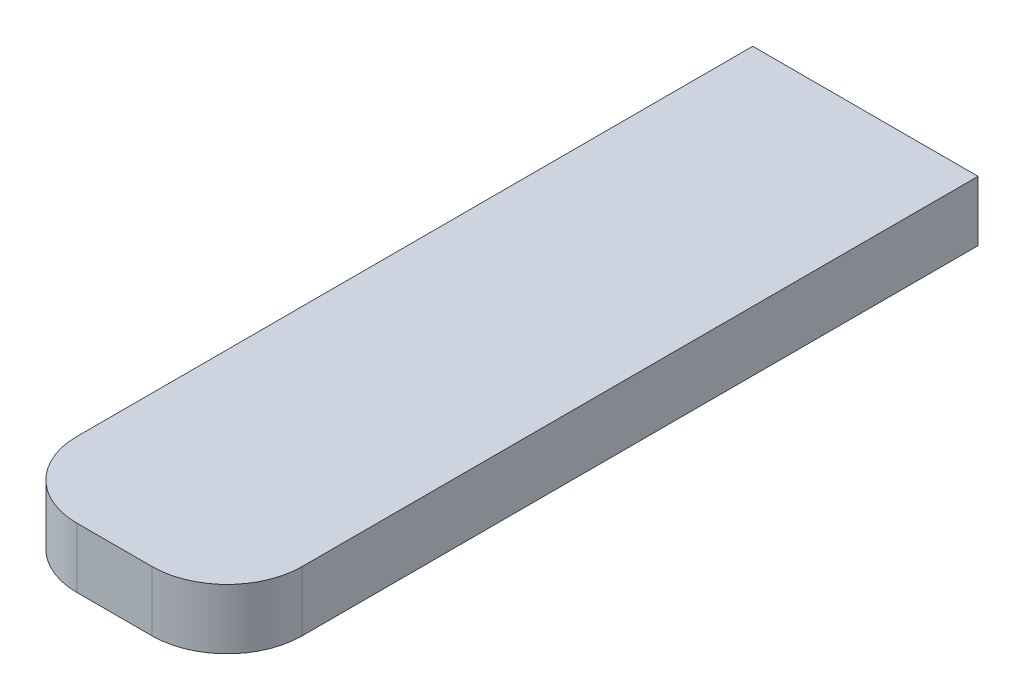
ISO-10303-21;
HEADER;
FILE_DESCRIPTION(('STEP AP214'),'2;1');
FILE_NAME('part.step','',(''),(''),'','','');
FILE_SCHEMA(('AUTOMOTIVE_DESIGN { 1 0 10303 214 1 1 1 1 }'));
ENDSEC;
DATA;
#1=APPLICATION_CONTEXT('core data for automotive mechanical design processes');
#2=APPLICATION_PROTOCOL_DEFINITION('international standard','automotive_design',2000,#1);
#3=PRODUCT_CONTEXT('',#1,'mechanical');
#4=PRODUCT('Part','Part','',(#3));
#5=PRODUCT_RELATED_PRODUCT_CATEGORY('part','',(#4));
#6=PRODUCT_DEFINITION_FORMATION('','',#4);
#7=PRODUCT_DEFINITION_CONTEXT('part definition',#1,'design');
#8=PRODUCT_DEFINITION('design','',#6,#7);
#9=PRODUCT_DEFINITION_SHAPE('','',#8);
#10=(LENGTH_UNIT() NAMED_UNIT(*) SI_UNIT(.MILLI.,.METRE.));
#11=(NAMED_UNIT(*) PLANE_ANGLE_UNIT() SI_UNIT($,.RADIAN.));
#12=(NAMED_UNIT(*) SI_UNIT($,.STERADIAN.) SOLID_ANGLE_UNIT());
#13=UNCERTAINTY_MEASURE_WITH_UNIT(LENGTH_MEASURE(1.E-05),#10,'distance_accuracy_value','');
#14=(GEOMETRIC_REPRESENTATION_CONTEXT(3) GLOBAL_UNCERTAINTY_ASSIGNED_CONTEXT((#13)) GLOBAL_UNIT_ASSIGNED_CONTEXT((#10,
#11,#12)) REPRESENTATION_CONTEXT('',''));
#15=CARTESIAN_POINT('',(0.,0.,0.));
#16=DIRECTION('',(0.,0.,1.));
#17=DIRECTION('',(1.,0.,0.));
#18=AXIS2_PLACEMENT_3D('',#15,#16,#17);
#19=CARTESIAN_POINT('',(0.,0.,90.2));
#20=DIRECTION('',(0.,0.,1.));
#21=DIRECTION('',(1.,0.,0.));
#22=AXIS2_PLACEMENT_3D('',#19,#20,#21);
#23=PLANE('',#22);
#24=DIRECTION('',(0.,1.,0.));
#25=VECTOR('',#24,1.);
#26=CARTESIAN_POINT('',(-50.,-56.,90.2));
#27=LINE('',#26,#25);
#28=CARTESIAN_POINT('',(-50.,-56.,90.2));
#29=VERTEX_POINT('',#28);
#30=CARTESIAN_POINT('',(-50.,-52.,90.2));
#31=VERTEX_POINT('',#30);
#32=EDGE_CURVE('E96',#29,#31,#27,.T.);
#33=ORIENTED_EDGE('',*,*,#32,.F.);
#34=DIRECTION('',(1.,0.,0.));
#35=VECTOR('',#34,1.);
#36=CARTESIAN_POINT('',(-50.,-56.,90.2));
#37=LINE('',#36,#35);
#38=CARTESIAN_POINT('',(-65.,-56.,90.2));
#39=VERTEX_POINT('',#38);
#40=EDGE_CURVE('E110',#39,#29,#37,.T.);
#41=ORIENTED_EDGE('',*,*,#40,.F.);
#42=DIRECTION('',(0.,-1.,0.));
#43=VECTOR('',#42,1.);
#44=CARTESIAN_POINT('',(-65.,-56.,90.2));
#45=LINE('',#44,#43);
#46=CARTESIAN_POINT('',(-65.,-52.,90.2));
#47=VERTEX_POINT('',#46);
#48=EDGE_CURVE('E98',#47,#39,#45,.T.);
#49=ORIENTED_EDGE('',*,*,#48,.F.);
#50=DIRECTION('',(-1.,0.,0.));
#51=VECTOR('',#50,1.);
#52=CARTESIAN_POINT('',(-50.,-52.,90.2));
#53=LINE('',#52,#51);
#54=EDGE_CURVE('E86',#31,#47,#53,.T.);
#55=ORIENTED_EDGE('',*,*,#54,.F.);
#56=EDGE_LOOP('',(#33,#41,#49,#55));
#57=FACE_BOUND('',#56,.T.);
#58=ADVANCED_FACE('F33',(#57),#23,.F.);
#59=CARTESIAN_POINT('',(-50.,-56.,140.2));
#60=DIRECTION('',(0.,1.,0.));
#61=DIRECTION('',(0.,0.,1.));
#62=AXIS2_PLACEMENT_3D('',#59,#60,#61);
#63=PLANE('',#62);
#64=DIRECTION('',(0.,0.,-1.));
#65=VECTOR('',#64,1.);
#66=CARTESIAN_POINT('',(-50.,-56.,140.2));
#67=LINE('',#66,#65);
#68=CARTESIAN_POINT('',(-50.,-56.,135.2));
#69=VERTEX_POINT('',#68);
#70=EDGE_CURVE('E102',#69,#29,#67,.T.);
#71=ORIENTED_EDGE('',*,*,#70,.F.);
#72=CARTESIAN_POINT('',(-55.,-56.,135.2));
#73=DIRECTION('',(0.,1.,0.));
#74=DIRECTION('',(0.,0.,1.));
#75=AXIS2_PLACEMENT_3D('',#72,#73,#74);
#76=CIRCLE('',#75,5.);
#77=CARTESIAN_POINT('',(-55.,-56.,140.2));
#78=VERTEX_POINT('',#77);
#79=EDGE_CURVE('E41',#69,#78,#76,.F.);
#80=ORIENTED_EDGE('',*,*,#79,.T.);
#81=DIRECTION('',(1.,0.,0.));
#82=VECTOR('',#81,1.);
#83=CARTESIAN_POINT('',(-50.,-56.,140.2));
#84=LINE('',#83,#82);
#85=CARTESIAN_POINT('',(-60.,-56.,140.2));
#86=VERTEX_POINT('',#85);
#87=EDGE_CURVE('E106',#86,#78,#84,.T.);
#88=ORIENTED_EDGE('',*,*,#87,.F.);
#89=CARTESIAN_POINT('',(-60.,-56.,135.2));
#90=DIRECTION('',(0.,1.,0.));
#91=DIRECTION('',(0.,0.,1.));
#92=AXIS2_PLACEMENT_3D('',#89,#90,#91);
#93=CIRCLE('',#92,5.);
#94=CARTESIAN_POINT('',(-65.,-56.,135.2));
#95=VERTEX_POINT('',#94);
#96=EDGE_CURVE('E125',#86,#95,#93,.F.);
#97=ORIENTED_EDGE('',*,*,#96,.T.);
#98=DIRECTION('',(0.,0.,-1.));
#99=VECTOR('',#98,1.);
#100=CARTESIAN_POINT('',(-65.,-56.,140.2));
#101=LINE('',#100,#99);
#102=EDGE_CURVE('E114',#95,#39,#101,.T.);
#103=ORIENTED_EDGE('',*,*,#102,.T.);
#104=ORIENTED_EDGE('',*,*,#40,.T.);
#105=EDGE_LOOP('',(#71,#80,#88,#97,#103,#104));
#106=FACE_BOUND('',#105,.T.);
#107=ADVANCED_FACE('F133',(#106),#63,.F.);
#108=CARTESIAN_POINT('',(-60.,0.,135.2));
#109=DIRECTION('',(0.,1.,0.));
#110=DIRECTION('',(0.,0.,1.));
#111=AXIS2_PLACEMENT_3D('',#108,#109,#110);
#112=CYLINDRICAL_SURFACE('',#111,5.);
#113=DIRECTION('',(0.,-1.,0.));
#114=VECTOR('',#113,1.);
#115=CARTESIAN_POINT('',(-60.,0.,140.2));
#116=LINE('',#115,#114);
#117=CARTESIAN_POINT('',(-60.,-52.,140.2));
#118=VERTEX_POINT('',#117);
#119=EDGE_CURVE('E90',#118,#86,#116,.T.);
#120=ORIENTED_EDGE('',*,*,#119,.F.);
#121=CARTESIAN_POINT('',(-60.,-52.,135.2));
#122=DIRECTION('',(0.,-1.,0.));
#123=DIRECTION('',(0.,0.,-1.));
#124=AXIS2_PLACEMENT_3D('',#121,#122,#123);
#125=CIRCLE('',#124,5.);
#126=CARTESIAN_POINT('',(-65.,-52.,135.2));
#127=VERTEX_POINT('',#126);
#128=EDGE_CURVE('E122',#127,#118,#125,.F.);
#129=ORIENTED_EDGE('',*,*,#128,.F.);
#130=DIRECTION('',(0.,-1.,0.));
#131=VECTOR('',#130,1.);
#132=CARTESIAN_POINT('',(-65.,0.,135.2));
#133=LINE('',#132,#131);
#134=EDGE_CURVE('E119',#95,#127,#133,.F.);
#135=ORIENTED_EDGE('',*,*,#134,.F.);
#136=ORIENTED_EDGE('',*,*,#96,.F.);
#137=EDGE_LOOP('',(#120,#129,#135,#136));
#138=FACE_BOUND('',#137,.T.);
#139=ADVANCED_FACE('F140',(#138),#112,.T.);
#140=CARTESIAN_POINT('',(-65.,-56.,140.2));
#141=DIRECTION('',(1.,0.,0.));
#142=DIRECTION('',(0.,0.,-1.));
#143=AXIS2_PLACEMENT_3D('',#140,#141,#142);
#144=PLANE('',#143);
#145=ORIENTED_EDGE('',*,*,#102,.F.);
#146=ORIENTED_EDGE('',*,*,#134,.T.);
#147=DIRECTION('',(0.,0.,-1.));
#148=VECTOR('',#147,1.);
#149=CARTESIAN_POINT('',(-65.,-52.,140.2));
#150=LINE('',#149,#148);
#151=EDGE_CURVE('E91',#127,#47,#150,.T.);
#152=ORIENTED_EDGE('',*,*,#151,.T.);
#153=ORIENTED_EDGE('',*,*,#48,.T.);
#154=EDGE_LOOP('',(#145,#146,#152,#153));
#155=FACE_BOUND('',#154,.T.);
#156=ADVANCED_FACE('F143',(#155),#144,.F.);
#157=CARTESIAN_POINT('',(-50.,-56.,140.2));
#158=DIRECTION('',(-1.,0.,0.));
#159=DIRECTION('',(0.,0.,1.));
#160=AXIS2_PLACEMENT_3D('',#157,#158,#159);
#161=PLANE('',#160);
#162=DIRECTION('',(0.,0.,-1.));
#163=VECTOR('',#162,1.);
#164=CARTESIAN_POINT('',(-50.,-52.,140.2));
#165=LINE('',#164,#163);
#166=CARTESIAN_POINT('',(-50.,-52.,135.2));
#167=VERTEX_POINT('',#166);
#168=EDGE_CURVE('E82',#167,#31,#165,.T.);
#169=ORIENTED_EDGE('',*,*,#168,.F.);
#170=DIRECTION('',(0.,1.,0.));
#171=VECTOR('',#170,1.);
#172=CARTESIAN_POINT('',(-50.,0.,135.2));
#173=LINE('',#172,#171);
#174=EDGE_CURVE('E130',#167,#69,#173,.F.);
#175=ORIENTED_EDGE('',*,*,#174,.T.);
#176=ORIENTED_EDGE('',*,*,#70,.T.);
#177=ORIENTED_EDGE('',*,*,#32,.T.);
#178=EDGE_LOOP('',(#169,#175,#176,#177));
#179=FACE_BOUND('',#178,.T.);
#180=ADVANCED_FACE('F100',(#179),#161,.F.);
#181=CARTESIAN_POINT('',(-55.,0.,135.2));
#182=DIRECTION('',(0.,-1.,0.));
#183=DIRECTION('',(0.,0.,-1.));
#184=AXIS2_PLACEMENT_3D('',#181,#182,#183);
#185=CYLINDRICAL_SURFACE('',#184,5.);
#186=DIRECTION('',(0.,1.,0.));
#187=VECTOR('',#186,1.);
#188=CARTESIAN_POINT('',(-55.,0.,140.2));
#189=LINE('',#188,#187);
#190=CARTESIAN_POINT('',(-55.,-52.,140.2));
#191=VERTEX_POINT('',#190);
#192=EDGE_CURVE('E127',#78,#191,#189,.T.);
#193=ORIENTED_EDGE('',*,*,#192,.F.);
#194=ORIENTED_EDGE('',*,*,#79,.F.);
#195=ORIENTED_EDGE('',*,*,#174,.F.);
#196=CARTESIAN_POINT('',(-55.,-52.,135.2));
#197=DIRECTION('',(0.,-1.,0.));
#198=DIRECTION('',(0.,0.,-1.));
#199=AXIS2_PLACEMENT_3D('',#196,#197,#198);
#200=CIRCLE('',#199,5.);
#201=EDGE_CURVE('E11',#191,#167,#200,.F.);
#202=ORIENTED_EDGE('',*,*,#201,.F.);
#203=EDGE_LOOP('',(#193,#194,#195,#202));
#204=FACE_BOUND('',#203,.T.);
#205=ADVANCED_FACE('F35',(#204),#185,.T.);
#206=CARTESIAN_POINT('',(0.,0.,140.2));
#207=DIRECTION('',(0.,0.,1.));
#208=DIRECTION('',(1.,0.,0.));
#209=AXIS2_PLACEMENT_3D('',#206,#207,#208);
#210=PLANE('',#209);
#211=ORIENTED_EDGE('',*,*,#87,.T.);
#212=ORIENTED_EDGE('',*,*,#192,.T.);
#213=DIRECTION('',(-1.,0.,0.));
#214=VECTOR('',#213,1.);
#215=CARTESIAN_POINT('',(-50.,-52.,140.2));
#216=LINE('',#215,#214);
#217=EDGE_CURVE('E112',#191,#118,#216,.T.);
#218=ORIENTED_EDGE('',*,*,#217,.T.);
#219=ORIENTED_EDGE('',*,*,#119,.T.);
#220=EDGE_LOOP('',(#211,#212,#218,#219));
#221=FACE_BOUND('',#220,.T.);
#222=ADVANCED_FACE('F136',(#221),#210,.T.);
#223=CARTESIAN_POINT('',(-50.,-52.,140.2));
#224=DIRECTION('',(0.,-1.,0.));
#225=DIRECTION('',(0.,0.,-1.));
#226=AXIS2_PLACEMENT_3D('',#223,#224,#225);
#227=PLANE('',#226);
#228=ORIENTED_EDGE('',*,*,#217,.F.);
#229=ORIENTED_EDGE('',*,*,#201,.T.);
#230=ORIENTED_EDGE('',*,*,#168,.T.);
#231=ORIENTED_EDGE('',*,*,#54,.T.);
#232=ORIENTED_EDGE('',*,*,#151,.F.);
#233=ORIENTED_EDGE('',*,*,#128,.T.);
#234=EDGE_LOOP('',(#228,#229,#230,#231,#232,#233));
#235=FACE_BOUND('',#234,.T.);
#236=ADVANCED_FACE('F84',(#235),#227,.F.);
#237=CLOSED_SHELL('',(#58,#107,#139,#156,#180,#205,#222,#236));
#238=MANIFOLD_SOLID_BREP('B2',#237);
#239=ADVANCED_BREP_SHAPE_REPRESENTATION('',(#18,#238),#14);
#240=SHAPE_DEFINITION_REPRESENTATION(#9,#239);
ENDSEC;
END-ISO-10303-21;
